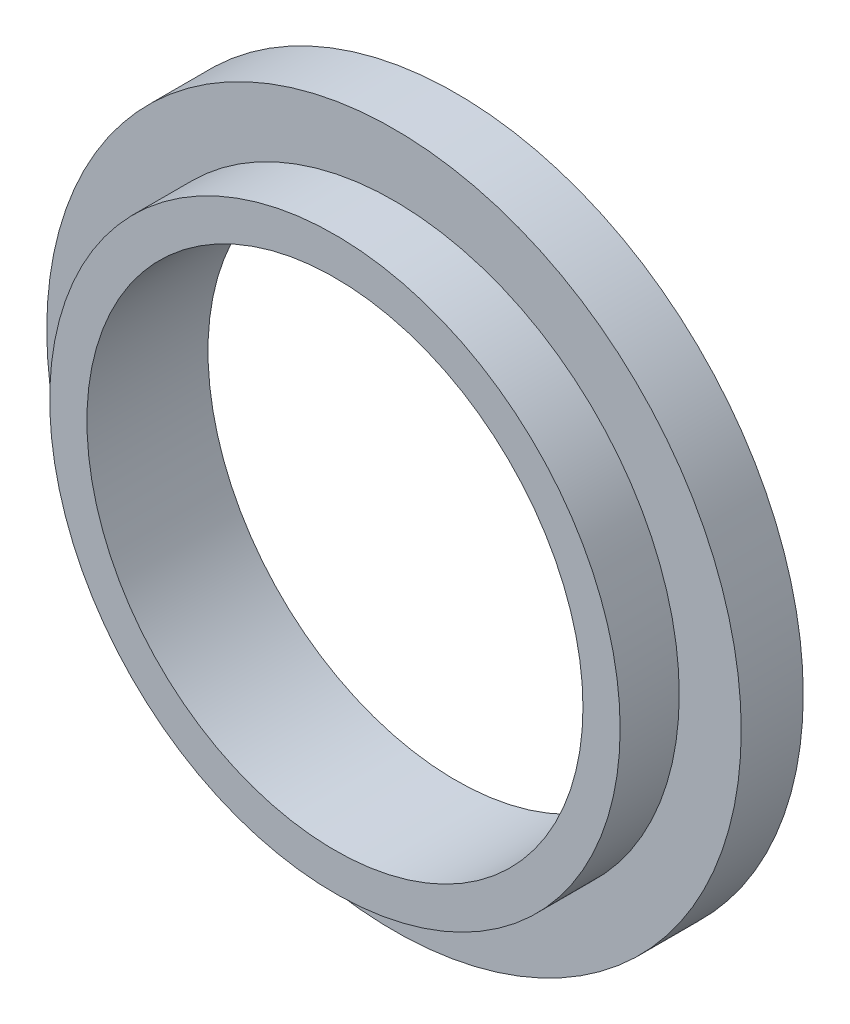
ISO-10303-21;
HEADER;
FILE_DESCRIPTION(('STEP AP214'),'2;1');
FILE_NAME('part.step','',(''),(''),'','','');
FILE_SCHEMA(('AUTOMOTIVE_DESIGN { 1 0 10303 214 1 1 1 1 }'));
ENDSEC;
DATA;
#1=APPLICATION_CONTEXT('core data for automotive mechanical design processes');
#2=APPLICATION_PROTOCOL_DEFINITION('international standard','automotive_design',2000,#1);
#3=PRODUCT_CONTEXT('',#1,'mechanical');
#4=PRODUCT('Part','Part','',(#3));
#5=PRODUCT_RELATED_PRODUCT_CATEGORY('part','',(#4));
#6=PRODUCT_DEFINITION_FORMATION('','',#4);
#7=PRODUCT_DEFINITION_CONTEXT('part definition',#1,'design');
#8=PRODUCT_DEFINITION('design','',#6,#7);
#9=PRODUCT_DEFINITION_SHAPE('','',#8);
#10=(LENGTH_UNIT() NAMED_UNIT(*) SI_UNIT(.MILLI.,.METRE.));
#11=(NAMED_UNIT(*) PLANE_ANGLE_UNIT() SI_UNIT($,.RADIAN.));
#12=(NAMED_UNIT(*) SI_UNIT($,.STERADIAN.) SOLID_ANGLE_UNIT());
#13=UNCERTAINTY_MEASURE_WITH_UNIT(LENGTH_MEASURE(1.E-05),#10,'distance_accuracy_value','');
#14=(GEOMETRIC_REPRESENTATION_CONTEXT(3) GLOBAL_UNCERTAINTY_ASSIGNED_CONTEXT((#13)) GLOBAL_UNIT_ASSIGNED_CONTEXT((#10,
#11,#12)) REPRESENTATION_CONTEXT('',''));
#15=CARTESIAN_POINT('',(0.,0.,0.));
#16=DIRECTION('',(0.,0.,1.));
#17=DIRECTION('',(1.,0.,0.));
#18=AXIS2_PLACEMENT_3D('',#15,#16,#17);
#19=CARTESIAN_POINT('',(0.,0.,5.));
#20=DIRECTION('',(0.,0.,-1.));
#21=DIRECTION('',(-1.,0.,0.));
#22=AXIS2_PLACEMENT_3D('',#19,#20,#21);
#23=CYLINDRICAL_SURFACE('',#22,28.);
#24=CARTESIAN_POINT('',(0.,0.,5.));
#25=DIRECTION('',(0.,0.,1.));
#26=DIRECTION('',(1.,0.,0.));
#27=AXIS2_PLACEMENT_3D('',#24,#25,#26);
#28=CIRCLE('',#27,28.);
#29=CARTESIAN_POINT('',(28.,0.,5.));
#30=VERTEX_POINT('',#29);
#31=EDGE_CURVE('E45',#30,#30,#28,.T.);
#32=ORIENTED_EDGE('',*,*,#31,.F.);
#33=EDGE_LOOP('',(#32));
#34=FACE_BOUND('',#33,.T.);
#35=CARTESIAN_POINT('',(0.,0.,0.));
#36=DIRECTION('',(0.,0.,1.));
#37=DIRECTION('',(1.,0.,0.));
#38=AXIS2_PLACEMENT_3D('',#35,#36,#37);
#39=CIRCLE('',#38,28.);
#40=CARTESIAN_POINT('',(28.,0.,0.));
#41=VERTEX_POINT('',#40);
#42=EDGE_CURVE('E51',#41,#41,#39,.T.);
#43=ORIENTED_EDGE('',*,*,#42,.T.);
#44=EDGE_LOOP('',(#43));
#45=FACE_BOUND('',#44,.T.);
#46=ADVANCED_FACE('F37',(#34,#45),#23,.T.);
#47=CARTESIAN_POINT('',(0.,0.,5.));
#48=DIRECTION('',(0.,0.,1.));
#49=DIRECTION('',(1.,0.,0.));
#50=AXIS2_PLACEMENT_3D('',#47,#48,#49);
#51=PLANE('',#50);
#52=CARTESIAN_POINT('',(0.,0.,5.));
#53=DIRECTION('',(0.,0.,1.));
#54=DIRECTION('',(1.,0.,0.));
#55=AXIS2_PLACEMENT_3D('',#52,#53,#54);
#56=CIRCLE('',#55,23.);
#57=CARTESIAN_POINT('',(23.,0.,5.));
#58=VERTEX_POINT('',#57);
#59=EDGE_CURVE('E10',#58,#58,#56,.T.);
#60=ORIENTED_EDGE('',*,*,#59,.F.);
#61=EDGE_LOOP('',(#60));
#62=FACE_BOUND('',#61,.T.);
#63=ORIENTED_EDGE('',*,*,#31,.T.);
#64=EDGE_LOOP('',(#63));
#65=FACE_BOUND('',#64,.T.);
#66=ADVANCED_FACE('F87',(#62,#65),#51,.T.);
#67=CARTESIAN_POINT('',(0.,0.,0.));
#68=DIRECTION('',(0.,0.,1.));
#69=DIRECTION('',(1.,0.,0.));
#70=AXIS2_PLACEMENT_3D('',#67,#68,#69);
#71=PLANE('',#70);
#72=CARTESIAN_POINT('',(0.,0.,0.));
#73=DIRECTION('',(0.,0.,1.));
#74=DIRECTION('',(1.,0.,0.));
#75=AXIS2_PLACEMENT_3D('',#72,#73,#74);
#76=CIRCLE('',#75,20.);
#77=CARTESIAN_POINT('',(20.,0.,0.));
#78=VERTEX_POINT('',#77);
#79=EDGE_CURVE('E66',#78,#78,#76,.T.);
#80=ORIENTED_EDGE('',*,*,#79,.T.);
#81=EDGE_LOOP('',(#80));
#82=FACE_BOUND('',#81,.T.);
#83=ORIENTED_EDGE('',*,*,#42,.F.);
#84=EDGE_LOOP('',(#83));
#85=FACE_BOUND('',#84,.T.);
#86=ADVANCED_FACE('F73',(#82,#85),#71,.F.);
#87=CARTESIAN_POINT('',(0.,0.,9.7625));
#88=DIRECTION('',(0.,0.,-1.));
#89=DIRECTION('',(-1.,0.,0.));
#90=AXIS2_PLACEMENT_3D('',#87,#88,#89);
#91=CYLINDRICAL_SURFACE('',#90,23.);
#92=CARTESIAN_POINT('',(0.,0.,9.7625));
#93=DIRECTION('',(0.,0.,1.));
#94=DIRECTION('',(1.,0.,0.));
#95=AXIS2_PLACEMENT_3D('',#92,#93,#94);
#96=CIRCLE('',#95,23.);
#97=CARTESIAN_POINT('',(23.,0.,9.7625));
#98=VERTEX_POINT('',#97);
#99=EDGE_CURVE('E54',#98,#98,#96,.T.);
#100=ORIENTED_EDGE('',*,*,#99,.F.);
#101=EDGE_LOOP('',(#100));
#102=FACE_BOUND('',#101,.T.);
#103=ORIENTED_EDGE('',*,*,#59,.T.);
#104=EDGE_LOOP('',(#103));
#105=FACE_BOUND('',#104,.T.);
#106=ADVANCED_FACE('F83',(#102,#105),#91,.T.);
#107=CARTESIAN_POINT('',(0.,0.,9.7625));
#108=DIRECTION('',(0.,0.,1.));
#109=DIRECTION('',(1.,0.,0.));
#110=AXIS2_PLACEMENT_3D('',#107,#108,#109);
#111=PLANE('',#110);
#112=CARTESIAN_POINT('',(0.,0.,9.7625));
#113=DIRECTION('',(0.,0.,1.));
#114=DIRECTION('',(1.,0.,0.));
#115=AXIS2_PLACEMENT_3D('',#112,#113,#114);
#116=CIRCLE('',#115,20.);
#117=CARTESIAN_POINT('',(20.,0.,9.7625));
#118=VERTEX_POINT('',#117);
#119=EDGE_CURVE('E40',#118,#118,#116,.T.);
#120=ORIENTED_EDGE('',*,*,#119,.F.);
#121=EDGE_LOOP('',(#120));
#122=FACE_BOUND('',#121,.T.);
#123=ORIENTED_EDGE('',*,*,#99,.T.);
#124=EDGE_LOOP('',(#123));
#125=FACE_BOUND('',#124,.T.);
#126=ADVANCED_FACE('F78',(#122,#125),#111,.T.);
#127=CARTESIAN_POINT('',(0.,0.,0.));
#128=DIRECTION('',(0.,0.,1.));
#129=DIRECTION('',(1.,0.,0.));
#130=AXIS2_PLACEMENT_3D('',#127,#128,#129);
#131=CYLINDRICAL_SURFACE('',#130,20.);
#132=ORIENTED_EDGE('',*,*,#119,.T.);
#133=EDGE_LOOP('',(#132));
#134=FACE_BOUND('',#133,.T.);
#135=ORIENTED_EDGE('',*,*,#79,.F.);
#136=EDGE_LOOP('',(#135));
#137=FACE_BOUND('',#136,.T.);
#138=ADVANCED_FACE('F76',(#134,#137),#131,.F.);
#139=CLOSED_SHELL('',(#46,#66,#86,#106,#126,#138));
#140=MANIFOLD_SOLID_BREP('B2',#139);
#141=ADVANCED_BREP_SHAPE_REPRESENTATION('',(#18,#140),#14);
#142=SHAPE_DEFINITION_REPRESENTATION(#9,#141);
ENDSEC;
END-ISO-10303-21;
